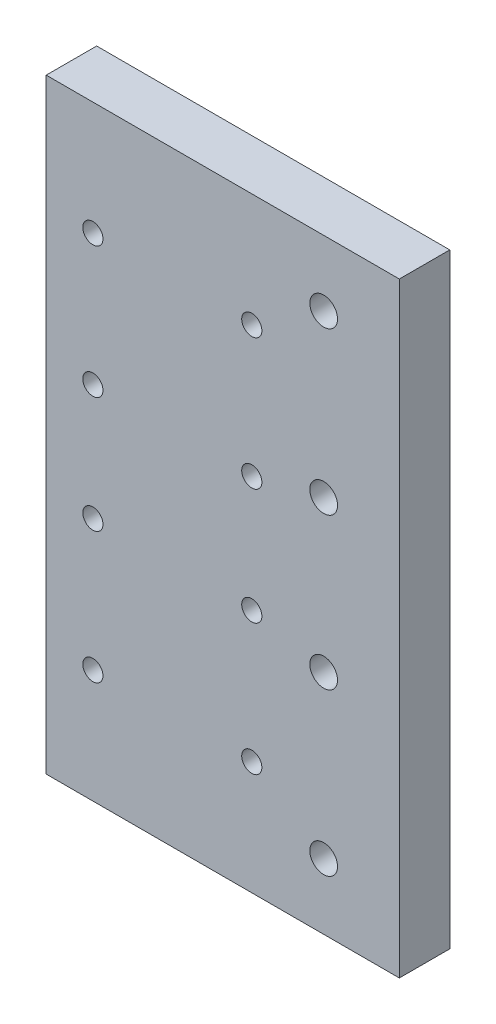
ISO-10303-21;
HEADER;
FILE_DESCRIPTION(('STEP AP214'),'2;1');
FILE_NAME('part.step','',(''),(''),'','','');
FILE_SCHEMA(('AUTOMOTIVE_DESIGN { 1 0 10303 214 1 1 1 1 }'));
ENDSEC;
DATA;
#1=APPLICATION_CONTEXT('core data for automotive mechanical design processes');
#2=APPLICATION_PROTOCOL_DEFINITION('international standard','automotive_design',2000,#1);
#3=PRODUCT_CONTEXT('',#1,'mechanical');
#4=PRODUCT('Part','Part','',(#3));
#5=PRODUCT_RELATED_PRODUCT_CATEGORY('part','',(#4));
#6=PRODUCT_DEFINITION_FORMATION('','',#4);
#7=PRODUCT_DEFINITION_CONTEXT('part definition',#1,'design');
#8=PRODUCT_DEFINITION('design','',#6,#7);
#9=PRODUCT_DEFINITION_SHAPE('','',#8);
#10=(LENGTH_UNIT() NAMED_UNIT(*) SI_UNIT(.MILLI.,.METRE.));
#11=(NAMED_UNIT(*) PLANE_ANGLE_UNIT() SI_UNIT($,.RADIAN.));
#12=(NAMED_UNIT(*) SI_UNIT($,.STERADIAN.) SOLID_ANGLE_UNIT());
#13=UNCERTAINTY_MEASURE_WITH_UNIT(LENGTH_MEASURE(1.E-05),#10,'distance_accuracy_value','');
#14=(GEOMETRIC_REPRESENTATION_CONTEXT(3) GLOBAL_UNCERTAINTY_ASSIGNED_CONTEXT((#13)) GLOBAL_UNIT_ASSIGNED_CONTEXT((#10,
#11,#12)) REPRESENTATION_CONTEXT('',''));
#15=CARTESIAN_POINT('',(0.,0.,0.));
#16=DIRECTION('',(0.,0.,1.));
#17=DIRECTION('',(1.,0.,0.));
#18=AXIS2_PLACEMENT_3D('',#15,#16,#17);
#19=CARTESIAN_POINT('',(0.,0.,10.));
#20=DIRECTION('',(0.,0.,1.));
#21=DIRECTION('',(1.,0.,0.));
#22=AXIS2_PLACEMENT_3D('',#19,#20,#21);
#23=PLANE('',#22);
#24=CARTESIAN_POINT('',(-15.,-15.,10.));
#25=DIRECTION('',(0.,0.,1.));
#26=DIRECTION('',(1.,0.,0.));
#27=AXIS2_PLACEMENT_3D('',#24,#25,#26);
#28=CIRCLE('',#27,2.75000000000001);
#29=CARTESIAN_POINT('',(-12.25,-15.,10.));
#30=VERTEX_POINT('',#29);
#31=EDGE_CURVE('E169',#30,#30,#28,.T.);
#32=ORIENTED_EDGE('',*,*,#31,.F.);
#33=EDGE_LOOP('',(#32));
#34=FACE_BOUND('',#33,.T.);
#35=CARTESIAN_POINT('',(-15.,47.,10.));
#36=DIRECTION('',(0.,0.,1.));
#37=DIRECTION('',(1.,0.,0.));
#38=AXIS2_PLACEMENT_3D('',#35,#36,#37);
#39=CIRCLE('',#38,2.75000000000001);
#40=CARTESIAN_POINT('',(-12.25,47.,10.));
#41=VERTEX_POINT('',#40);
#42=EDGE_CURVE('E157',#41,#41,#39,.T.);
#43=ORIENTED_EDGE('',*,*,#42,.F.);
#44=EDGE_LOOP('',(#43));
#45=FACE_BOUND('',#44,.T.);
#46=CARTESIAN_POINT('',(-29.25,-37.5,10.));
#47=DIRECTION('',(0.,0.,1.));
#48=DIRECTION('',(1.,0.,0.));
#49=AXIS2_PLACEMENT_3D('',#46,#47,#48);
#50=CIRCLE('',#49,2.);
#51=CARTESIAN_POINT('',(-27.25,-37.5,10.));
#52=VERTEX_POINT('',#51);
#53=EDGE_CURVE('E145',#52,#52,#50,.T.);
#54=ORIENTED_EDGE('',*,*,#53,.F.);
#55=EDGE_LOOP('',(#54));
#56=FACE_BOUND('',#55,.T.);
#57=CARTESIAN_POINT('',(-60.75,-11.5,10.));
#58=DIRECTION('',(0.,0.,1.));
#59=DIRECTION('',(1.,0.,0.));
#60=AXIS2_PLACEMENT_3D('',#57,#58,#59);
#61=CIRCLE('',#60,2.);
#62=CARTESIAN_POINT('',(-58.75,-11.5,10.));
#63=VERTEX_POINT('',#62);
#64=EDGE_CURVE('E133',#63,#63,#61,.T.);
#65=ORIENTED_EDGE('',*,*,#64,.F.);
#66=EDGE_LOOP('',(#65));
#67=FACE_BOUND('',#66,.T.);
#68=CARTESIAN_POINT('',(-60.75,11.5,10.));
#69=DIRECTION('',(0.,0.,1.));
#70=DIRECTION('',(1.,0.,0.));
#71=AXIS2_PLACEMENT_3D('',#68,#69,#70);
#72=CIRCLE('',#71,2.);
#73=CARTESIAN_POINT('',(-58.75,11.5,10.));
#74=VERTEX_POINT('',#73);
#75=EDGE_CURVE('E121',#74,#74,#72,.T.);
#76=ORIENTED_EDGE('',*,*,#75,.F.);
#77=EDGE_LOOP('',(#76));
#78=FACE_BOUND('',#77,.T.);
#79=CARTESIAN_POINT('',(-60.75,37.5,10.));
#80=DIRECTION('',(0.,0.,1.));
#81=DIRECTION('',(1.,0.,0.));
#82=AXIS2_PLACEMENT_3D('',#79,#80,#81);
#83=CIRCLE('',#82,2.);
#84=CARTESIAN_POINT('',(-58.75,37.5,10.));
#85=VERTEX_POINT('',#84);
#86=EDGE_CURVE('E100',#85,#85,#83,.T.);
#87=ORIENTED_EDGE('',*,*,#86,.F.);
#88=EDGE_LOOP('',(#87));
#89=FACE_BOUND('',#88,.T.);
#90=DIRECTION('',(-1.,0.,0.));
#91=VECTOR('',#90,1.);
#92=CARTESIAN_POINT('',(0.,60.,10.));
#93=LINE('',#92,#91);
#94=CARTESIAN_POINT('',(0.,60.,10.));
#95=VERTEX_POINT('',#94);
#96=CARTESIAN_POINT('',(-70.,60.,10.));
#97=VERTEX_POINT('',#96);
#98=EDGE_CURVE('E85',#95,#97,#93,.T.);
#99=ORIENTED_EDGE('',*,*,#98,.T.);
#100=DIRECTION('',(0.,-1.,0.));
#101=VECTOR('',#100,1.);
#102=CARTESIAN_POINT('',(-70.,60.,10.));
#103=LINE('',#102,#101);
#104=CARTESIAN_POINT('',(-70.,-60.,10.));
#105=VERTEX_POINT('',#104);
#106=EDGE_CURVE('E80',#97,#105,#103,.T.);
#107=ORIENTED_EDGE('',*,*,#106,.T.);
#108=DIRECTION('',(1.,0.,0.));
#109=VECTOR('',#108,1.);
#110=CARTESIAN_POINT('',(-70.,-60.,10.));
#111=LINE('',#110,#109);
#112=CARTESIAN_POINT('',(0.,-60.,10.));
#113=VERTEX_POINT('',#112);
#114=EDGE_CURVE('E83',#105,#113,#111,.T.);
#115=ORIENTED_EDGE('',*,*,#114,.T.);
#116=DIRECTION('',(0.,1.,0.));
#117=VECTOR('',#116,1.);
#118=CARTESIAN_POINT('',(0.,-60.,10.));
#119=LINE('',#118,#117);
#120=EDGE_CURVE('E50',#113,#95,#119,.T.);
#121=ORIENTED_EDGE('',*,*,#120,.T.);
#122=EDGE_LOOP('',(#99,#107,#115,#121));
#123=FACE_BOUND('',#122,.T.);
#124=CARTESIAN_POINT('',(-29.25,37.5,10.));
#125=DIRECTION('',(0.,0.,1.));
#126=DIRECTION('',(1.,0.,0.));
#127=AXIS2_PLACEMENT_3D('',#124,#125,#126);
#128=CIRCLE('',#127,2.);
#129=CARTESIAN_POINT('',(-27.25,37.5,10.));
#130=VERTEX_POINT('',#129);
#131=EDGE_CURVE('E115',#130,#130,#128,.T.);
#132=ORIENTED_EDGE('',*,*,#131,.F.);
#133=EDGE_LOOP('',(#132));
#134=FACE_BOUND('',#133,.T.);
#135=CARTESIAN_POINT('',(-29.25,11.5,10.));
#136=DIRECTION('',(0.,0.,1.));
#137=DIRECTION('',(1.,0.,0.));
#138=AXIS2_PLACEMENT_3D('',#135,#136,#137);
#139=CIRCLE('',#138,2.);
#140=CARTESIAN_POINT('',(-27.25,11.5,10.));
#141=VERTEX_POINT('',#140);
#142=EDGE_CURVE('E127',#141,#141,#139,.T.);
#143=ORIENTED_EDGE('',*,*,#142,.F.);
#144=EDGE_LOOP('',(#143));
#145=FACE_BOUND('',#144,.T.);
#146=CARTESIAN_POINT('',(-29.25,-11.5,10.));
#147=DIRECTION('',(0.,0.,1.));
#148=DIRECTION('',(1.,0.,0.));
#149=AXIS2_PLACEMENT_3D('',#146,#147,#148);
#150=CIRCLE('',#149,2.);
#151=CARTESIAN_POINT('',(-27.25,-11.5,10.));
#152=VERTEX_POINT('',#151);
#153=EDGE_CURVE('E139',#152,#152,#150,.T.);
#154=ORIENTED_EDGE('',*,*,#153,.F.);
#155=EDGE_LOOP('',(#154));
#156=FACE_BOUND('',#155,.T.);
#157=CARTESIAN_POINT('',(-60.75,-37.5,10.));
#158=DIRECTION('',(0.,0.,1.));
#159=DIRECTION('',(1.,0.,0.));
#160=AXIS2_PLACEMENT_3D('',#157,#158,#159);
#161=CIRCLE('',#160,2.);
#162=CARTESIAN_POINT('',(-58.75,-37.5,10.));
#163=VERTEX_POINT('',#162);
#164=EDGE_CURVE('E151',#163,#163,#161,.T.);
#165=ORIENTED_EDGE('',*,*,#164,.F.);
#166=EDGE_LOOP('',(#165));
#167=FACE_BOUND('',#166,.T.);
#168=CARTESIAN_POINT('',(-15.,15.,10.));
#169=DIRECTION('',(0.,0.,1.));
#170=DIRECTION('',(1.,0.,0.));
#171=AXIS2_PLACEMENT_3D('',#168,#169,#170);
#172=CIRCLE('',#171,2.75000000000001);
#173=CARTESIAN_POINT('',(-12.25,15.,10.));
#174=VERTEX_POINT('',#173);
#175=EDGE_CURVE('E163',#174,#174,#172,.T.);
#176=ORIENTED_EDGE('',*,*,#175,.F.);
#177=EDGE_LOOP('',(#176));
#178=FACE_BOUND('',#177,.T.);
#179=CARTESIAN_POINT('',(-15.,-47.,10.));
#180=DIRECTION('',(0.,0.,1.));
#181=DIRECTION('',(1.,0.,0.));
#182=AXIS2_PLACEMENT_3D('',#179,#180,#181);
#183=CIRCLE('',#182,2.75000000000001);
#184=CARTESIAN_POINT('',(-12.25,-47.,10.));
#185=VERTEX_POINT('',#184);
#186=EDGE_CURVE('E175',#185,#185,#183,.T.);
#187=ORIENTED_EDGE('',*,*,#186,.F.);
#188=EDGE_LOOP('',(#187));
#189=FACE_BOUND('',#188,.T.);
#190=ADVANCED_FACE('F33',(#34,#45,#56,#67,#78,#89,#123,#134,#145,#156,#167,#178,#189),#23,.T.);
#191=CARTESIAN_POINT('',(0.,0.,0.));
#192=DIRECTION('',(0.,0.,1.));
#193=DIRECTION('',(1.,0.,0.));
#194=AXIS2_PLACEMENT_3D('',#191,#192,#193);
#195=PLANE('',#194);
#196=DIRECTION('',(-1.,0.,0.));
#197=VECTOR('',#196,1.);
#198=CARTESIAN_POINT('',(0.,60.,0.));
#199=LINE('',#198,#197);
#200=CARTESIAN_POINT('',(0.,60.,0.));
#201=VERTEX_POINT('',#200);
#202=CARTESIAN_POINT('',(-70.,60.,0.));
#203=VERTEX_POINT('',#202);
#204=EDGE_CURVE('E97',#201,#203,#199,.T.);
#205=ORIENTED_EDGE('',*,*,#204,.F.);
#206=DIRECTION('',(0.,1.,0.));
#207=VECTOR('',#206,1.);
#208=CARTESIAN_POINT('',(0.,-60.,0.));
#209=LINE('',#208,#207);
#210=CARTESIAN_POINT('',(0.,-60.,0.));
#211=VERTEX_POINT('',#210);
#212=EDGE_CURVE('E73',#211,#201,#209,.T.);
#213=ORIENTED_EDGE('',*,*,#212,.F.);
#214=DIRECTION('',(1.,0.,0.));
#215=VECTOR('',#214,1.);
#216=CARTESIAN_POINT('',(-70.,-60.,0.));
#217=LINE('',#216,#215);
#218=CARTESIAN_POINT('',(-70.,-60.,0.));
#219=VERTEX_POINT('',#218);
#220=EDGE_CURVE('E67',#219,#211,#217,.T.);
#221=ORIENTED_EDGE('',*,*,#220,.F.);
#222=DIRECTION('',(0.,-1.,0.));
#223=VECTOR('',#222,1.);
#224=CARTESIAN_POINT('',(-70.,60.,0.));
#225=LINE('',#224,#223);
#226=EDGE_CURVE('E89',#203,#219,#225,.T.);
#227=ORIENTED_EDGE('',*,*,#226,.F.);
#228=EDGE_LOOP('',(#205,#213,#221,#227));
#229=FACE_BOUND('',#228,.T.);
#230=CARTESIAN_POINT('',(-60.75,37.5,0.));
#231=DIRECTION('',(0.,0.,1.));
#232=DIRECTION('',(1.,0.,0.));
#233=AXIS2_PLACEMENT_3D('',#230,#231,#232);
#234=CIRCLE('',#233,2.);
#235=CARTESIAN_POINT('',(-58.75,37.5,0.));
#236=VERTEX_POINT('',#235);
#237=EDGE_CURVE('E112',#236,#236,#234,.T.);
#238=ORIENTED_EDGE('',*,*,#237,.T.);
#239=EDGE_LOOP('',(#238));
#240=FACE_BOUND('',#239,.T.);
#241=CARTESIAN_POINT('',(-29.25,37.5,0.));
#242=DIRECTION('',(0.,0.,1.));
#243=DIRECTION('',(1.,0.,0.));
#244=AXIS2_PLACEMENT_3D('',#241,#242,#243);
#245=CIRCLE('',#244,2.);
#246=CARTESIAN_POINT('',(-27.25,37.5,0.));
#247=VERTEX_POINT('',#246);
#248=EDGE_CURVE('E118',#247,#247,#245,.T.);
#249=ORIENTED_EDGE('',*,*,#248,.T.);
#250=EDGE_LOOP('',(#249));
#251=FACE_BOUND('',#250,.T.);
#252=CARTESIAN_POINT('',(-60.75,11.5,0.));
#253=DIRECTION('',(0.,0.,1.));
#254=DIRECTION('',(1.,0.,0.));
#255=AXIS2_PLACEMENT_3D('',#252,#253,#254);
#256=CIRCLE('',#255,2.);
#257=CARTESIAN_POINT('',(-58.75,11.5,0.));
#258=VERTEX_POINT('',#257);
#259=EDGE_CURVE('E124',#258,#258,#256,.T.);
#260=ORIENTED_EDGE('',*,*,#259,.T.);
#261=EDGE_LOOP('',(#260));
#262=FACE_BOUND('',#261,.T.);
#263=CARTESIAN_POINT('',(-29.25,11.5,0.));
#264=DIRECTION('',(0.,0.,1.));
#265=DIRECTION('',(1.,0.,0.));
#266=AXIS2_PLACEMENT_3D('',#263,#264,#265);
#267=CIRCLE('',#266,2.);
#268=CARTESIAN_POINT('',(-27.25,11.5,0.));
#269=VERTEX_POINT('',#268);
#270=EDGE_CURVE('E130',#269,#269,#267,.T.);
#271=ORIENTED_EDGE('',*,*,#270,.T.);
#272=EDGE_LOOP('',(#271));
#273=FACE_BOUND('',#272,.T.);
#274=CARTESIAN_POINT('',(-60.75,-11.5,0.));
#275=DIRECTION('',(0.,0.,1.));
#276=DIRECTION('',(1.,0.,0.));
#277=AXIS2_PLACEMENT_3D('',#274,#275,#276);
#278=CIRCLE('',#277,2.);
#279=CARTESIAN_POINT('',(-58.75,-11.5,0.));
#280=VERTEX_POINT('',#279);
#281=EDGE_CURVE('E136',#280,#280,#278,.T.);
#282=ORIENTED_EDGE('',*,*,#281,.T.);
#283=EDGE_LOOP('',(#282));
#284=FACE_BOUND('',#283,.T.);
#285=CARTESIAN_POINT('',(-29.25,-11.5,0.));
#286=DIRECTION('',(0.,0.,1.));
#287=DIRECTION('',(1.,0.,0.));
#288=AXIS2_PLACEMENT_3D('',#285,#286,#287);
#289=CIRCLE('',#288,2.);
#290=CARTESIAN_POINT('',(-27.25,-11.5,0.));
#291=VERTEX_POINT('',#290);
#292=EDGE_CURVE('E142',#291,#291,#289,.T.);
#293=ORIENTED_EDGE('',*,*,#292,.T.);
#294=EDGE_LOOP('',(#293));
#295=FACE_BOUND('',#294,.T.);
#296=CARTESIAN_POINT('',(-29.25,-37.5,0.));
#297=DIRECTION('',(0.,0.,1.));
#298=DIRECTION('',(1.,0.,0.));
#299=AXIS2_PLACEMENT_3D('',#296,#297,#298);
#300=CIRCLE('',#299,2.);
#301=CARTESIAN_POINT('',(-27.25,-37.5,0.));
#302=VERTEX_POINT('',#301);
#303=EDGE_CURVE('E148',#302,#302,#300,.T.);
#304=ORIENTED_EDGE('',*,*,#303,.T.);
#305=EDGE_LOOP('',(#304));
#306=FACE_BOUND('',#305,.T.);
#307=CARTESIAN_POINT('',(-60.75,-37.5,0.));
#308=DIRECTION('',(0.,0.,1.));
#309=DIRECTION('',(1.,0.,0.));
#310=AXIS2_PLACEMENT_3D('',#307,#308,#309);
#311=CIRCLE('',#310,2.);
#312=CARTESIAN_POINT('',(-58.75,-37.5,0.));
#313=VERTEX_POINT('',#312);
#314=EDGE_CURVE('E154',#313,#313,#311,.T.);
#315=ORIENTED_EDGE('',*,*,#314,.T.);
#316=EDGE_LOOP('',(#315));
#317=FACE_BOUND('',#316,.T.);
#318=CARTESIAN_POINT('',(-15.,47.,0.));
#319=DIRECTION('',(0.,0.,1.));
#320=DIRECTION('',(1.,0.,0.));
#321=AXIS2_PLACEMENT_3D('',#318,#319,#320);
#322=CIRCLE('',#321,2.75000000000001);
#323=CARTESIAN_POINT('',(-12.25,47.,0.));
#324=VERTEX_POINT('',#323);
#325=EDGE_CURVE('E160',#324,#324,#322,.T.);
#326=ORIENTED_EDGE('',*,*,#325,.T.);
#327=EDGE_LOOP('',(#326));
#328=FACE_BOUND('',#327,.T.);
#329=CARTESIAN_POINT('',(-15.,15.,0.));
#330=DIRECTION('',(0.,0.,1.));
#331=DIRECTION('',(1.,0.,0.));
#332=AXIS2_PLACEMENT_3D('',#329,#330,#331);
#333=CIRCLE('',#332,2.75000000000001);
#334=CARTESIAN_POINT('',(-12.25,15.,0.));
#335=VERTEX_POINT('',#334);
#336=EDGE_CURVE('E166',#335,#335,#333,.T.);
#337=ORIENTED_EDGE('',*,*,#336,.T.);
#338=EDGE_LOOP('',(#337));
#339=FACE_BOUND('',#338,.T.);
#340=CARTESIAN_POINT('',(-15.,-15.,0.));
#341=DIRECTION('',(0.,0.,1.));
#342=DIRECTION('',(1.,0.,0.));
#343=AXIS2_PLACEMENT_3D('',#340,#341,#342);
#344=CIRCLE('',#343,2.75000000000001);
#345=CARTESIAN_POINT('',(-12.25,-15.,0.));
#346=VERTEX_POINT('',#345);
#347=EDGE_CURVE('E172',#346,#346,#344,.T.);
#348=ORIENTED_EDGE('',*,*,#347,.T.);
#349=EDGE_LOOP('',(#348));
#350=FACE_BOUND('',#349,.T.);
#351=CARTESIAN_POINT('',(-15.,-47.,0.));
#352=DIRECTION('',(0.,0.,1.));
#353=DIRECTION('',(1.,0.,0.));
#354=AXIS2_PLACEMENT_3D('',#351,#352,#353);
#355=CIRCLE('',#354,2.75000000000001);
#356=CARTESIAN_POINT('',(-12.25,-47.,0.));
#357=VERTEX_POINT('',#356);
#358=EDGE_CURVE('E178',#357,#357,#355,.T.);
#359=ORIENTED_EDGE('',*,*,#358,.T.);
#360=EDGE_LOOP('',(#359));
#361=FACE_BOUND('',#360,.T.);
#362=ADVANCED_FACE('F108',(#229,#240,#251,#262,#273,#284,#295,#306,#317,#328,#339,#350,#361),
#195,.F.);
#363=CARTESIAN_POINT('',(0.,60.,10.));
#364=DIRECTION('',(0.,-1.,0.));
#365=DIRECTION('',(1.,0.,0.));
#366=AXIS2_PLACEMENT_3D('',#363,#364,#365);
#367=PLANE('',#366);
#368=ORIENTED_EDGE('',*,*,#204,.T.);
#369=DIRECTION('',(0.,0.,-1.));
#370=VECTOR('',#369,1.);
#371=CARTESIAN_POINT('',(-70.,60.,10.));
#372=LINE('',#371,#370);
#373=EDGE_CURVE('E11',#97,#203,#372,.T.);
#374=ORIENTED_EDGE('',*,*,#373,.F.);
#375=ORIENTED_EDGE('',*,*,#98,.F.);
#376=DIRECTION('',(0.,0.,-1.));
#377=VECTOR('',#376,1.);
#378=CARTESIAN_POINT('',(0.,60.,10.));
#379=LINE('',#378,#377);
#380=EDGE_CURVE('E93',#95,#201,#379,.T.);
#381=ORIENTED_EDGE('',*,*,#380,.T.);
#382=EDGE_LOOP('',(#368,#374,#375,#381));
#383=FACE_BOUND('',#382,.T.);
#384=ADVANCED_FACE('F35',(#383),#367,.F.);
#385=CARTESIAN_POINT('',(-70.,60.,10.));
#386=DIRECTION('',(1.,0.,0.));
#387=DIRECTION('',(0.,0.,-1.));
#388=AXIS2_PLACEMENT_3D('',#385,#386,#387);
#389=PLANE('',#388);
#390=ORIENTED_EDGE('',*,*,#226,.T.);
#391=DIRECTION('',(0.,0.,-1.));
#392=VECTOR('',#391,1.);
#393=CARTESIAN_POINT('',(-70.,-60.,10.));
#394=LINE('',#393,#392);
#395=EDGE_CURVE('E42',#105,#219,#394,.T.);
#396=ORIENTED_EDGE('',*,*,#395,.F.);
#397=ORIENTED_EDGE('',*,*,#106,.F.);
#398=ORIENTED_EDGE('',*,*,#373,.T.);
#399=EDGE_LOOP('',(#390,#396,#397,#398));
#400=FACE_BOUND('',#399,.T.);
#401=ADVANCED_FACE('F88',(#400),#389,.F.);
#402=CARTESIAN_POINT('',(-70.,-60.,10.));
#403=DIRECTION('',(0.,1.,0.));
#404=DIRECTION('',(0.,0.,1.));
#405=AXIS2_PLACEMENT_3D('',#402,#403,#404);
#406=PLANE('',#405);
#407=ORIENTED_EDGE('',*,*,#220,.T.);
#408=DIRECTION('',(0.,0.,-1.));
#409=VECTOR('',#408,1.);
#410=CARTESIAN_POINT('',(0.,-60.,10.));
#411=LINE('',#410,#409);
#412=EDGE_CURVE('E90',#113,#211,#411,.T.);
#413=ORIENTED_EDGE('',*,*,#412,.F.);
#414=ORIENTED_EDGE('',*,*,#114,.F.);
#415=ORIENTED_EDGE('',*,*,#395,.T.);
#416=EDGE_LOOP('',(#407,#413,#414,#415));
#417=FACE_BOUND('',#416,.T.);
#418=ADVANCED_FACE('F91',(#417),#406,.F.);
#419=CARTESIAN_POINT('',(0.,-60.,10.));
#420=DIRECTION('',(-1.,0.,0.));
#421=DIRECTION('',(0.,0.,1.));
#422=AXIS2_PLACEMENT_3D('',#419,#420,#421);
#423=PLANE('',#422);
#424=ORIENTED_EDGE('',*,*,#212,.T.);
#425=ORIENTED_EDGE('',*,*,#380,.F.);
#426=ORIENTED_EDGE('',*,*,#120,.F.);
#427=ORIENTED_EDGE('',*,*,#412,.T.);
#428=EDGE_LOOP('',(#424,#425,#426,#427));
#429=FACE_BOUND('',#428,.T.);
#430=ADVANCED_FACE('F105',(#429),#423,.F.);
#431=CARTESIAN_POINT('',(-60.75,37.5,10.));
#432=DIRECTION('',(0.,0.,-1.));
#433=DIRECTION('',(-1.,0.,0.));
#434=AXIS2_PLACEMENT_3D('',#431,#432,#433);
#435=CYLINDRICAL_SURFACE('',#434,2.);
#436=ORIENTED_EDGE('',*,*,#86,.T.);
#437=EDGE_LOOP('',(#436));
#438=FACE_BOUND('',#437,.T.);
#439=ORIENTED_EDGE('',*,*,#237,.F.);
#440=EDGE_LOOP('',(#439));
#441=FACE_BOUND('',#440,.T.);
#442=ADVANCED_FACE('F197',(#438,#441),#435,.F.);
#443=CARTESIAN_POINT('',(-29.25,37.5,10.));
#444=DIRECTION('',(0.,0.,-1.));
#445=DIRECTION('',(-1.,0.,0.));
#446=AXIS2_PLACEMENT_3D('',#443,#444,#445);
#447=CYLINDRICAL_SURFACE('',#446,2.);
#448=ORIENTED_EDGE('',*,*,#131,.T.);
#449=EDGE_LOOP('',(#448));
#450=FACE_BOUND('',#449,.T.);
#451=ORIENTED_EDGE('',*,*,#248,.F.);
#452=EDGE_LOOP('',(#451));
#453=FACE_BOUND('',#452,.T.);
#454=ADVANCED_FACE('F243',(#450,#453),#447,.F.);
#455=CARTESIAN_POINT('',(-60.75,11.5,10.));
#456=DIRECTION('',(0.,0.,-1.));
#457=DIRECTION('',(-1.,0.,0.));
#458=AXIS2_PLACEMENT_3D('',#455,#456,#457);
#459=CYLINDRICAL_SURFACE('',#458,2.);
#460=ORIENTED_EDGE('',*,*,#75,.T.);
#461=EDGE_LOOP('',(#460));
#462=FACE_BOUND('',#461,.T.);
#463=ORIENTED_EDGE('',*,*,#259,.F.);
#464=EDGE_LOOP('',(#463));
#465=FACE_BOUND('',#464,.T.);
#466=ADVANCED_FACE('F251',(#462,#465),#459,.F.);
#467=CARTESIAN_POINT('',(-29.25,11.5,10.));
#468=DIRECTION('',(0.,0.,-1.));
#469=DIRECTION('',(-1.,0.,0.));
#470=AXIS2_PLACEMENT_3D('',#467,#468,#469);
#471=CYLINDRICAL_SURFACE('',#470,2.);
#472=ORIENTED_EDGE('',*,*,#142,.T.);
#473=EDGE_LOOP('',(#472));
#474=FACE_BOUND('',#473,.T.);
#475=ORIENTED_EDGE('',*,*,#270,.F.);
#476=EDGE_LOOP('',(#475));
#477=FACE_BOUND('',#476,.T.);
#478=ADVANCED_FACE('F259',(#474,#477),#471,.F.);
#479=CARTESIAN_POINT('',(-60.75,-11.5,10.));
#480=DIRECTION('',(0.,0.,-1.));
#481=DIRECTION('',(-1.,0.,0.));
#482=AXIS2_PLACEMENT_3D('',#479,#480,#481);
#483=CYLINDRICAL_SURFACE('',#482,2.);
#484=ORIENTED_EDGE('',*,*,#64,.T.);
#485=EDGE_LOOP('',(#484));
#486=FACE_BOUND('',#485,.T.);
#487=ORIENTED_EDGE('',*,*,#281,.F.);
#488=EDGE_LOOP('',(#487));
#489=FACE_BOUND('',#488,.T.);
#490=ADVANCED_FACE('F268',(#486,#489),#483,.F.);
#491=CARTESIAN_POINT('',(-29.25,-11.5,10.));
#492=DIRECTION('',(0.,0.,-1.));
#493=DIRECTION('',(-1.,0.,0.));
#494=AXIS2_PLACEMENT_3D('',#491,#492,#493);
#495=CYLINDRICAL_SURFACE('',#494,2.);
#496=ORIENTED_EDGE('',*,*,#153,.T.);
#497=EDGE_LOOP('',(#496));
#498=FACE_BOUND('',#497,.T.);
#499=ORIENTED_EDGE('',*,*,#292,.F.);
#500=EDGE_LOOP('',(#499));
#501=FACE_BOUND('',#500,.T.);
#502=ADVANCED_FACE('F277',(#498,#501),#495,.F.);
#503=CARTESIAN_POINT('',(-29.25,-37.5,10.));
#504=DIRECTION('',(0.,0.,-1.));
#505=DIRECTION('',(-1.,0.,0.));
#506=AXIS2_PLACEMENT_3D('',#503,#504,#505);
#507=CYLINDRICAL_SURFACE('',#506,2.);
#508=ORIENTED_EDGE('',*,*,#53,.T.);
#509=EDGE_LOOP('',(#508));
#510=FACE_BOUND('',#509,.T.);
#511=ORIENTED_EDGE('',*,*,#303,.F.);
#512=EDGE_LOOP('',(#511));
#513=FACE_BOUND('',#512,.T.);
#514=ADVANCED_FACE('F286',(#510,#513),#507,.F.);
#515=CARTESIAN_POINT('',(-60.75,-37.5,10.));
#516=DIRECTION('',(0.,0.,-1.));
#517=DIRECTION('',(-1.,0.,0.));
#518=AXIS2_PLACEMENT_3D('',#515,#516,#517);
#519=CYLINDRICAL_SURFACE('',#518,2.);
#520=ORIENTED_EDGE('',*,*,#164,.T.);
#521=EDGE_LOOP('',(#520));
#522=FACE_BOUND('',#521,.T.);
#523=ORIENTED_EDGE('',*,*,#314,.F.);
#524=EDGE_LOOP('',(#523));
#525=FACE_BOUND('',#524,.T.);
#526=ADVANCED_FACE('F295',(#522,#525),#519,.F.);
#527=CARTESIAN_POINT('',(-15.,47.,10.));
#528=DIRECTION('',(0.,0.,-1.));
#529=DIRECTION('',(-1.,0.,0.));
#530=AXIS2_PLACEMENT_3D('',#527,#528,#529);
#531=CYLINDRICAL_SURFACE('',#530,2.75000000000001);
#532=ORIENTED_EDGE('',*,*,#42,.T.);
#533=EDGE_LOOP('',(#532));
#534=FACE_BOUND('',#533,.T.);
#535=ORIENTED_EDGE('',*,*,#325,.F.);
#536=EDGE_LOOP('',(#535));
#537=FACE_BOUND('',#536,.T.);
#538=ADVANCED_FACE('F304',(#534,#537),#531,.F.);
#539=CARTESIAN_POINT('',(-15.,15.,10.));
#540=DIRECTION('',(0.,0.,-1.));
#541=DIRECTION('',(-1.,0.,0.));
#542=AXIS2_PLACEMENT_3D('',#539,#540,#541);
#543=CYLINDRICAL_SURFACE('',#542,2.75000000000001);
#544=ORIENTED_EDGE('',*,*,#175,.T.);
#545=EDGE_LOOP('',(#544));
#546=FACE_BOUND('',#545,.T.);
#547=ORIENTED_EDGE('',*,*,#336,.F.);
#548=EDGE_LOOP('',(#547));
#549=FACE_BOUND('',#548,.T.);
#550=ADVANCED_FACE('F313',(#546,#549),#543,.F.);
#551=CARTESIAN_POINT('',(-15.,-15.,10.));
#552=DIRECTION('',(0.,0.,-1.));
#553=DIRECTION('',(-1.,0.,0.));
#554=AXIS2_PLACEMENT_3D('',#551,#552,#553);
#555=CYLINDRICAL_SURFACE('',#554,2.75000000000001);
#556=ORIENTED_EDGE('',*,*,#31,.T.);
#557=EDGE_LOOP('',(#556));
#558=FACE_BOUND('',#557,.T.);
#559=ORIENTED_EDGE('',*,*,#347,.F.);
#560=EDGE_LOOP('',(#559));
#561=FACE_BOUND('',#560,.T.);
#562=ADVANCED_FACE('F322',(#558,#561),#555,.F.);
#563=CARTESIAN_POINT('',(-15.,-47.,10.));
#564=DIRECTION('',(0.,0.,-1.));
#565=DIRECTION('',(-1.,0.,0.));
#566=AXIS2_PLACEMENT_3D('',#563,#564,#565);
#567=CYLINDRICAL_SURFACE('',#566,2.75000000000001);
#568=ORIENTED_EDGE('',*,*,#186,.T.);
#569=EDGE_LOOP('',(#568));
#570=FACE_BOUND('',#569,.T.);
#571=ORIENTED_EDGE('',*,*,#358,.F.);
#572=EDGE_LOOP('',(#571));
#573=FACE_BOUND('',#572,.T.);
#574=ADVANCED_FACE('F184',(#570,#573),#567,.F.);
#575=CLOSED_SHELL('',(#190,#362,#384,#401,#418,#430,#442,#454,#466,#478,#490,#502,#514,#526,
#538,#550,#562,#574));
#576=MANIFOLD_SOLID_BREP('B2',#575);
#577=ADVANCED_BREP_SHAPE_REPRESENTATION('',(#18,#576),#14);
#578=SHAPE_DEFINITION_REPRESENTATION(#9,#577);
ENDSEC;
END-ISO-10303-21;
